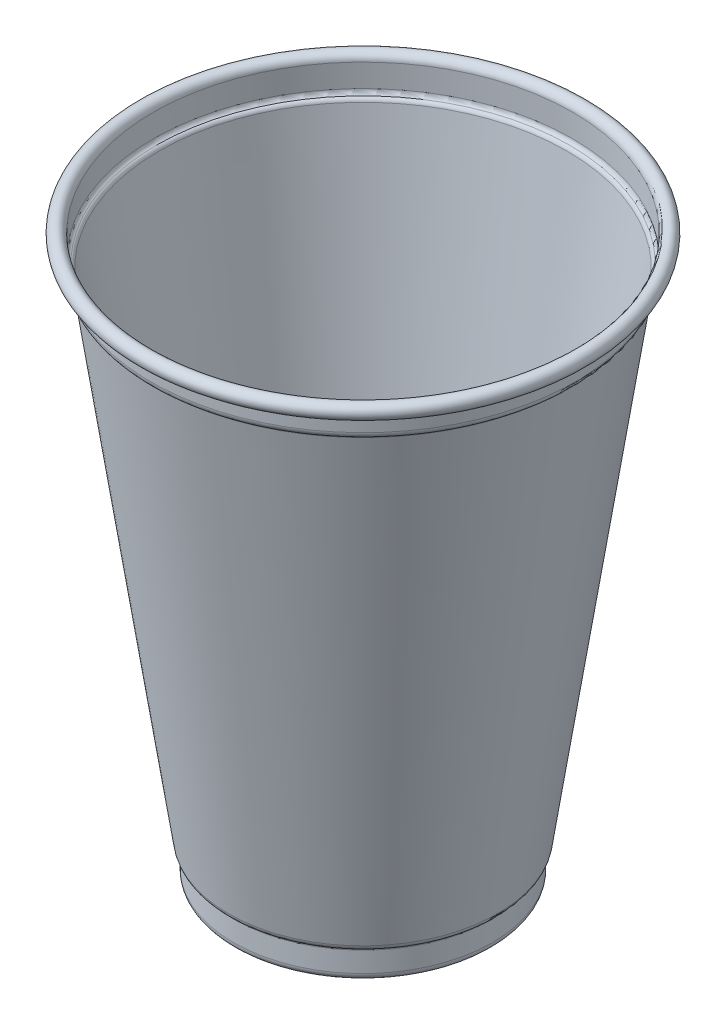
ISO-10303-21;
HEADER;
FILE_DESCRIPTION(('STEP AP214'),'2;1');
FILE_NAME('part.step','',(''),(''),'','','');
FILE_SCHEMA(('AUTOMOTIVE_DESIGN { 1 0 10303 214 1 1 1 1 }'));
ENDSEC;
DATA;
#1=APPLICATION_CONTEXT('core data for automotive mechanical design processes');
#2=APPLICATION_PROTOCOL_DEFINITION('international standard','automotive_design',2000,#1);
#3=PRODUCT_CONTEXT('',#1,'mechanical');
#4=PRODUCT('Part','Part','',(#3));
#5=PRODUCT_RELATED_PRODUCT_CATEGORY('part','',(#4));
#6=PRODUCT_DEFINITION_FORMATION('','',#4);
#7=PRODUCT_DEFINITION_CONTEXT('part definition',#1,'design');
#8=PRODUCT_DEFINITION('design','',#6,#7);
#9=PRODUCT_DEFINITION_SHAPE('','',#8);
#10=(LENGTH_UNIT() NAMED_UNIT(*) SI_UNIT(.MILLI.,.METRE.));
#11=(NAMED_UNIT(*) PLANE_ANGLE_UNIT() SI_UNIT($,.RADIAN.));
#12=(NAMED_UNIT(*) SI_UNIT($,.STERADIAN.) SOLID_ANGLE_UNIT());
#13=UNCERTAINTY_MEASURE_WITH_UNIT(LENGTH_MEASURE(1.E-05),#10,'distance_accuracy_value','');
#14=(GEOMETRIC_REPRESENTATION_CONTEXT(3) GLOBAL_UNCERTAINTY_ASSIGNED_CONTEXT((#13)) GLOBAL_UNIT_ASSIGNED_CONTEXT((#10,
#11,#12)) REPRESENTATION_CONTEXT('',''));
#15=CARTESIAN_POINT('',(0.,0.,0.));
#16=DIRECTION('',(0.,0.,1.));
#17=DIRECTION('',(1.,0.,0.));
#18=AXIS2_PLACEMENT_3D('',#15,#16,#17);
#19=CARTESIAN_POINT('',(0.,7.11442651473735,0.));
#20=DIRECTION('',(0.,-1.,0.));
#21=DIRECTION('',(0.,0.,-1.));
#22=AXIS2_PLACEMENT_3D('',#19,#20,#21);
#23=TOROIDAL_SURFACE('',#22,27.1827508937216,1.);
#24=CARTESIAN_POINT('',(0.,6.20721325736867,0.));
#25=DIRECTION('',(0.,-1.,0.));
#26=DIRECTION('',(0.,0.,-1.));
#27=AXIS2_PLACEMENT_3D('',#24,#25,#26);
#28=CIRCLE('',#27,27.6034219120418);
#29=CARTESIAN_POINT('',(0.,6.20721325736867,-27.6034219120418));
#30=VERTEX_POINT('',#29);
#31=EDGE_CURVE('E120',#30,#30,#28,.T.);
#32=ORIENTED_EDGE('',*,*,#31,.T.);
#33=EDGE_LOOP('',(#32));
#34=FACE_BOUND('',#33,.T.);
#35=CARTESIAN_POINT('',(0.,6.96931232730907,0.));
#36=DIRECTION('',(0.,-1.,0.));
#37=DIRECTION('',(0.,0.,-1.));
#38=AXIS2_PLACEMENT_3D('',#35,#36,#37);
#39=CIRCLE('',#38,28.1721658080053);
#40=CARTESIAN_POINT('',(0.,6.96931232730907,-28.1721658080053));
#41=VERTEX_POINT('',#40);
#42=EDGE_CURVE('E10',#41,#41,#39,.T.);
#43=ORIENTED_EDGE('',*,*,#42,.F.);
#44=EDGE_LOOP('',(#43));
#45=FACE_BOUND('',#44,.T.);
#46=ADVANCED_FACE('F32',(#34,#45),#23,.F.);
#47=CARTESIAN_POINT('',(0.,6.96931232730907,0.));
#48=DIRECTION('',(0.,1.,0.));
#49=DIRECTION('',(0.,0.,1.));
#50=AXIS2_PLACEMENT_3D('',#47,#48,#49);
#51=CONICAL_SURFACE('',#50,28.1721658080053,0.145628380570823);
#52=CARTESIAN_POINT('',(0.,111.845114187428,0.));
#53=DIRECTION('',(0.,-1.,0.));
#54=DIRECTION('',(0.,0.,-1.));
#55=AXIS2_PLACEMENT_3D('',#52,#53,#54);
#56=CIRCLE('',#55,43.5539500808228);
#57=CARTESIAN_POINT('',(0.,111.845114187428,-43.5539500808228));
#58=VERTEX_POINT('',#57);
#59=EDGE_CURVE('E38',#58,#58,#56,.T.);
#60=ORIENTED_EDGE('',*,*,#59,.F.);
#61=EDGE_LOOP('',(#60));
#62=FACE_BOUND('',#61,.T.);
#63=ORIENTED_EDGE('',*,*,#42,.T.);
#64=EDGE_LOOP('',(#63));
#65=FACE_BOUND('',#64,.T.);
#66=ADVANCED_FACE('F138',(#62,#65),#51,.F.);
#67=CARTESIAN_POINT('',(0.,111.7,0.));
#68=DIRECTION('',(0.,-1.,0.));
#69=DIRECTION('',(0.,0.,-1.));
#70=AXIS2_PLACEMENT_3D('',#67,#68,#69);
#71=TOROIDAL_SURFACE('',#70,44.5433649951065,1.);
#72=ORIENTED_EDGE('',*,*,#59,.T.);
#73=EDGE_LOOP('',(#72));
#74=FACE_BOUND('',#73,.T.);
#75=CARTESIAN_POINT('',(0.,112.617955879187,0.));
#76=DIRECTION('',(0.,-1.,0.));
#77=DIRECTION('',(0.,0.,-1.));
#78=AXIS2_PLACEMENT_3D('',#75,#76,#77);
#79=CIRCLE('',#78,44.1466824975533);
#80=CARTESIAN_POINT('',(0.,112.617955879187,-44.1466824975533));
#81=VERTEX_POINT('',#80);
#82=EDGE_CURVE('E42',#81,#81,#79,.T.);
#83=ORIENTED_EDGE('',*,*,#82,.F.);
#84=EDGE_LOOP('',(#83));
#85=FACE_BOUND('',#84,.T.);
#86=ADVANCED_FACE('F143',(#74,#85),#71,.T.);
#87=CARTESIAN_POINT('',(0.,113.535911758375,0.));
#88=DIRECTION('',(0.,-1.,0.));
#89=DIRECTION('',(0.,0.,-1.));
#90=AXIS2_PLACEMENT_3D('',#87,#88,#89);
#91=TOROIDAL_SURFACE('',#90,43.75,1.);
#92=ORIENTED_EDGE('',*,*,#82,.T.);
#93=EDGE_LOOP('',(#92));
#94=FACE_BOUND('',#93,.T.);
#95=CARTESIAN_POINT('',(0.,113.535911758375,0.));
#96=DIRECTION('',(0.,-1.,0.));
#97=DIRECTION('',(0.,0.,-1.));
#98=AXIS2_PLACEMENT_3D('',#95,#96,#97);
#99=CIRCLE('',#98,44.75);
#100=CARTESIAN_POINT('',(0.,113.535911758375,-44.75));
#101=VERTEX_POINT('',#100);
#102=EDGE_CURVE('E46',#101,#101,#99,.T.);
#103=ORIENTED_EDGE('',*,*,#102,.F.);
#104=EDGE_LOOP('',(#103));
#105=FACE_BOUND('',#104,.T.);
#106=ADVANCED_FACE('F149',(#94,#105),#91,.F.);
#107=CARTESIAN_POINT('',(0.,0.,0.));
#108=DIRECTION('',(0.,-1.,0.));
#109=DIRECTION('',(0.,0.,-1.));
#110=AXIS2_PLACEMENT_3D('',#107,#108,#109);
#111=CYLINDRICAL_SURFACE('',#110,44.75);
#112=ORIENTED_EDGE('',*,*,#102,.T.);
#113=EDGE_LOOP('',(#112));
#114=FACE_BOUND('',#113,.T.);
#115=CARTESIAN_POINT('',(0.,118.435222207308,0.));
#116=DIRECTION('',(0.,-1.,0.));
#117=DIRECTION('',(0.,0.,-1.));
#118=AXIS2_PLACEMENT_3D('',#115,#116,#117);
#119=CIRCLE('',#118,44.75);
#120=CARTESIAN_POINT('',(0.,118.435222207308,-44.75));
#121=VERTEX_POINT('',#120);
#122=EDGE_CURVE('E51',#121,#121,#119,.T.);
#123=ORIENTED_EDGE('',*,*,#122,.F.);
#124=EDGE_LOOP('',(#123));
#125=FACE_BOUND('',#124,.T.);
#126=ADVANCED_FACE('F154',(#114,#125),#111,.F.);
#127=CARTESIAN_POINT('',(0.,118.435222207308,0.));
#128=DIRECTION('',(0.,-1.,0.));
#129=DIRECTION('',(0.,0.,-1.));
#130=AXIS2_PLACEMENT_3D('',#127,#128,#129);
#131=TOROIDAL_SURFACE('',#130,46.2971345541354,1.54713455413545);
#132=CARTESIAN_POINT('',(0.,117.053809984678,0.));
#133=DIRECTION('',(0.,-1.,0.));
#134=DIRECTION('',(0.,0.,-1.));
#135=AXIS2_PLACEMENT_3D('',#132,#133,#134);
#136=CIRCLE('',#135,45.600481412486);
#137=CARTESIAN_POINT('',(0.,117.053809984678,-45.600481412486));
#138=VERTEX_POINT('',#137);
#139=EDGE_CURVE('E54',#138,#138,#136,.T.);
#140=ORIENTED_EDGE('',*,*,#139,.F.);
#141=EDGE_LOOP('',(#140));
#142=FACE_BOUND('',#141,.T.);
#143=ORIENTED_EDGE('',*,*,#122,.T.);
#144=EDGE_LOOP('',(#143));
#145=FACE_BOUND('',#144,.T.);
#146=ADVANCED_FACE('F158',(#142,#145),#131,.T.);
#147=CARTESIAN_POINT('',(0.,117.499602171082,0.));
#148=DIRECTION('',(0.,1.,0.));
#149=DIRECTION('',(0.,0.,1.));
#150=AXIS2_PLACEMENT_3D('',#147,#148,#149);
#151=CONICAL_SURFACE('',#150,45.826915538913,0.469976638417015);
#152=ORIENTED_EDGE('',*,*,#139,.T.);
#153=EDGE_LOOP('',(#152));
#154=FACE_BOUND('',#153,.T.);
#155=CARTESIAN_POINT('',(0.,117.499602171082,0.));
#156=DIRECTION('',(0.,-1.,0.));
#157=DIRECTION('',(0.,0.,-1.));
#158=AXIS2_PLACEMENT_3D('',#155,#156,#157);
#159=CIRCLE('',#158,45.826915538913);
#160=CARTESIAN_POINT('',(0.,117.499602171082,-45.826915538913));
#161=VERTEX_POINT('',#160);
#162=EDGE_CURVE('E57',#161,#161,#159,.T.);
#163=ORIENTED_EDGE('',*,*,#162,.F.);
#164=EDGE_LOOP('',(#163));
#165=FACE_BOUND('',#164,.T.);
#166=ADVANCED_FACE('F161',(#154,#165),#151,.F.);
#167=CARTESIAN_POINT('',(0.,118.435222207308,0.));
#168=DIRECTION('',(0.,-1.,0.));
#169=DIRECTION('',(0.,0.,-1.));
#170=AXIS2_PLACEMENT_3D('',#167,#168,#169);
#171=TOROIDAL_SURFACE('',#170,46.2971345541354,1.04713455413546);
#172=ORIENTED_EDGE('',*,*,#162,.T.);
#173=EDGE_LOOP('',(#172));
#174=FACE_BOUND('',#173,.T.);
#175=CARTESIAN_POINT('',(0.,118.435222207308,0.));
#176=DIRECTION('',(0.,-1.,0.));
#177=DIRECTION('',(0.,0.,-1.));
#178=AXIS2_PLACEMENT_3D('',#175,#176,#177);
#179=CIRCLE('',#178,45.25);
#180=CARTESIAN_POINT('',(0.,118.435222207308,-45.25));
#181=VERTEX_POINT('',#180);
#182=EDGE_CURVE('E60',#181,#181,#179,.T.);
#183=ORIENTED_EDGE('',*,*,#182,.F.);
#184=EDGE_LOOP('',(#183));
#185=FACE_BOUND('',#184,.T.);
#186=ADVANCED_FACE('F165',(#174,#185),#171,.F.);
#187=CARTESIAN_POINT('',(0.,0.,0.));
#188=DIRECTION('',(0.,-1.,0.));
#189=DIRECTION('',(0.,0.,-1.));
#190=AXIS2_PLACEMENT_3D('',#187,#188,#189);
#191=CYLINDRICAL_SURFACE('',#190,45.25);
#192=CARTESIAN_POINT('',(0.,113.535911758375,0.));
#193=DIRECTION('',(0.,-1.,0.));
#194=DIRECTION('',(0.,0.,-1.));
#195=AXIS2_PLACEMENT_3D('',#192,#193,#194);
#196=CIRCLE('',#195,45.25);
#197=CARTESIAN_POINT('',(0.,113.535911758375,-45.25));
#198=VERTEX_POINT('',#197);
#199=EDGE_CURVE('E63',#198,#198,#196,.T.);
#200=ORIENTED_EDGE('',*,*,#199,.F.);
#201=EDGE_LOOP('',(#200));
#202=FACE_BOUND('',#201,.T.);
#203=ORIENTED_EDGE('',*,*,#182,.T.);
#204=EDGE_LOOP('',(#203));
#205=FACE_BOUND('',#204,.T.);
#206=ADVANCED_FACE('F169',(#202,#205),#191,.T.);
#207=CARTESIAN_POINT('',(0.,113.535911758375,0.));
#208=DIRECTION('',(0.,-1.,0.));
#209=DIRECTION('',(0.,0.,-1.));
#210=AXIS2_PLACEMENT_3D('',#207,#208,#209);
#211=TOROIDAL_SURFACE('',#210,43.75,1.5);
#212=CARTESIAN_POINT('',(0.,112.158977939594,0.));
#213=DIRECTION('',(0.,-1.,0.));
#214=DIRECTION('',(0.,0.,-1.));
#215=AXIS2_PLACEMENT_3D('',#212,#213,#214);
#216=CIRCLE('',#215,44.3450237463299);
#217=CARTESIAN_POINT('',(0.,112.158977939594,-44.3450237463299));
#218=VERTEX_POINT('',#217);
#219=EDGE_CURVE('E66',#218,#218,#216,.T.);
#220=ORIENTED_EDGE('',*,*,#219,.F.);
#221=EDGE_LOOP('',(#220));
#222=FACE_BOUND('',#221,.T.);
#223=ORIENTED_EDGE('',*,*,#199,.T.);
#224=EDGE_LOOP('',(#223));
#225=FACE_BOUND('',#224,.T.);
#226=ADVANCED_FACE('F173',(#222,#225),#211,.T.);
#227=CARTESIAN_POINT('',(0.,111.7,0.));
#228=DIRECTION('',(0.,-1.,0.));
#229=DIRECTION('',(0.,0.,-1.));
#230=AXIS2_PLACEMENT_3D('',#227,#228,#229);
#231=TOROIDAL_SURFACE('',#230,44.5433649951065,0.500000000000005);
#232=CARTESIAN_POINT('',(0.,111.772557093714,0.));
#233=DIRECTION('',(0.,-1.,0.));
#234=DIRECTION('',(0.,0.,-1.));
#235=AXIS2_PLACEMENT_3D('',#232,#233,#234);
#236=CIRCLE('',#235,44.0486575379647);
#237=CARTESIAN_POINT('',(0.,111.772557093714,-44.0486575379647));
#238=VERTEX_POINT('',#237);
#239=EDGE_CURVE('E69',#238,#238,#236,.T.);
#240=ORIENTED_EDGE('',*,*,#239,.F.);
#241=EDGE_LOOP('',(#240));
#242=FACE_BOUND('',#241,.T.);
#243=ORIENTED_EDGE('',*,*,#219,.T.);
#244=EDGE_LOOP('',(#243));
#245=FACE_BOUND('',#244,.T.);
#246=ADVANCED_FACE('F177',(#242,#245),#231,.F.);
#247=CARTESIAN_POINT('',(0.,6.89675523359494,0.));
#248=DIRECTION('',(0.,1.,0.));
#249=DIRECTION('',(0.,0.,1.));
#250=AXIS2_PLACEMENT_3D('',#247,#248,#249);
#251=CONICAL_SURFACE('',#250,28.6668732651472,0.145628380570822);
#252=ORIENTED_EDGE('',*,*,#239,.T.);
#253=EDGE_LOOP('',(#252));
#254=FACE_BOUND('',#253,.T.);
#255=CARTESIAN_POINT('',(0.,6.89675523359494,0.));
#256=DIRECTION('',(0.,-1.,0.));
#257=DIRECTION('',(0.,0.,-1.));
#258=AXIS2_PLACEMENT_3D('',#255,#256,#257);
#259=CIRCLE('',#258,28.6668732651472);
#260=CARTESIAN_POINT('',(0.,6.89675523359494,-28.6668732651472));
#261=VERTEX_POINT('',#260);
#262=EDGE_CURVE('E72',#261,#261,#259,.T.);
#263=ORIENTED_EDGE('',*,*,#262,.F.);
#264=EDGE_LOOP('',(#263));
#265=FACE_BOUND('',#264,.T.);
#266=ADVANCED_FACE('F181',(#254,#265),#251,.T.);
#267=CARTESIAN_POINT('',(0.,7.11442651473735,0.));
#268=DIRECTION('',(0.,-1.,0.));
#269=DIRECTION('',(0.,0.,-1.));
#270=AXIS2_PLACEMENT_3D('',#267,#268,#269);
#271=TOROIDAL_SURFACE('',#270,27.1827508937216,1.5);
#272=CARTESIAN_POINT('',(0.,5.75360662868432,0.));
#273=DIRECTION('',(0.,-1.,0.));
#274=DIRECTION('',(0.,0.,-1.));
#275=AXIS2_PLACEMENT_3D('',#272,#273,#274);
#276=CIRCLE('',#275,27.8137574212018);
#277=CARTESIAN_POINT('',(0.,5.75360662868432,-27.8137574212018));
#278=VERTEX_POINT('',#277);
#279=EDGE_CURVE('E75',#278,#278,#276,.T.);
#280=ORIENTED_EDGE('',*,*,#279,.F.);
#281=EDGE_LOOP('',(#280));
#282=FACE_BOUND('',#281,.T.);
#283=ORIENTED_EDGE('',*,*,#262,.T.);
#284=EDGE_LOOP('',(#283));
#285=FACE_BOUND('',#284,.T.);
#286=ADVANCED_FACE('F184',(#282,#285),#271,.T.);
#287=CARTESIAN_POINT('',(0.,5.29999999999998,0.));
#288=DIRECTION('',(0.,-1.,0.));
#289=DIRECTION('',(0.,0.,-1.));
#290=AXIS2_PLACEMENT_3D('',#287,#288,#289);
#291=TOROIDAL_SURFACE('',#290,28.0240929303619,0.500000000000002);
#292=CARTESIAN_POINT('',(0.,5.28809861102683,0.));
#293=DIRECTION('',(0.,-1.,0.));
#294=DIRECTION('',(0.,0.,-1.));
#295=AXIS2_PLACEMENT_3D('',#292,#293,#294);
#296=CIRCLE('',#295,27.5242345934898);
#297=CARTESIAN_POINT('',(0.,5.28809861102683,-27.5242345934898));
#298=VERTEX_POINT('',#297);
#299=EDGE_CURVE('E78',#298,#298,#296,.T.);
#300=ORIENTED_EDGE('',*,*,#299,.F.);
#301=EDGE_LOOP('',(#300));
#302=FACE_BOUND('',#301,.T.);
#303=ORIENTED_EDGE('',*,*,#279,.T.);
#304=EDGE_LOOP('',(#303));
#305=FACE_BOUND('',#304,.T.);
#306=ADVANCED_FACE('F188',(#302,#305),#291,.F.);
#307=CARTESIAN_POINT('',(0.,5.28809861102683,0.));
#308=DIRECTION('',(0.,-1.,0.));
#309=DIRECTION('',(0.,0.,-1.));
#310=AXIS2_PLACEMENT_3D('',#307,#308,#309);
#311=CONICAL_SURFACE('',#310,27.5242345934898,0.0238050261850705);
#312=CARTESIAN_POINT('',(0.,1.03570416691944,0.));
#313=DIRECTION('',(0.,-1.,0.));
#314=DIRECTION('',(0.,0.,-1.));
#315=AXIS2_PLACEMENT_3D('',#312,#313,#314);
#316=CIRCLE('',#315,27.6254820802543);
#317=CARTESIAN_POINT('',(0.,1.03570416691944,-27.6254820802543));
#318=VERTEX_POINT('',#317);
#319=EDGE_CURVE('E81',#318,#318,#316,.T.);
#320=ORIENTED_EDGE('',*,*,#319,.F.);
#321=EDGE_LOOP('',(#320));
#322=FACE_BOUND('',#321,.T.);
#323=ORIENTED_EDGE('',*,*,#299,.T.);
#324=EDGE_LOOP('',(#323));
#325=FACE_BOUND('',#324,.T.);
#326=ADVANCED_FACE('F192',(#322,#325),#311,.T.);
#327=CARTESIAN_POINT('',(0.,0.999999999999997,0.));
#328=DIRECTION('',(0.,-1.,0.));
#329=DIRECTION('',(0.,0.,-1.));
#330=AXIS2_PLACEMENT_3D('',#327,#328,#329);
#331=TOROIDAL_SURFACE('',#330,26.1259070696381,1.5);
#332=CARTESIAN_POINT('',(0.,-0.500000000000004,0.));
#333=DIRECTION('',(0.,-1.,0.));
#334=DIRECTION('',(0.,0.,-1.));
#335=AXIS2_PLACEMENT_3D('',#332,#333,#334);
#336=CIRCLE('',#335,26.1259070696381);
#337=CARTESIAN_POINT('',(0.,-0.500000000000004,-26.1259070696381));
#338=VERTEX_POINT('',#337);
#339=EDGE_CURVE('E84',#338,#338,#336,.T.);
#340=ORIENTED_EDGE('',*,*,#339,.F.);
#341=EDGE_LOOP('',(#340));
#342=FACE_BOUND('',#341,.T.);
#343=ORIENTED_EDGE('',*,*,#319,.T.);
#344=EDGE_LOOP('',(#343));
#345=FACE_BOUND('',#344,.T.);
#346=ADVANCED_FACE('F196',(#342,#345),#331,.T.);
#347=CARTESIAN_POINT('',(-26.1259070696381,-0.500000000000004,0.));
#348=DIRECTION('',(0.,1.,0.));
#349=DIRECTION('',(0.,0.,1.));
#350=AXIS2_PLACEMENT_3D('',#347,#348,#349);
#351=PLANE('',#350);
#352=CARTESIAN_POINT('',(0.,-0.500000000000003,0.));
#353=DIRECTION('',(0.,-1.,0.));
#354=DIRECTION('',(0.,0.,-1.));
#355=AXIS2_PLACEMENT_3D('',#352,#353,#354);
#356=CIRCLE('',#355,19.6320353043957);
#357=CARTESIAN_POINT('',(0.,-0.500000000000003,-19.6320353043957));
#358=VERTEX_POINT('',#357);
#359=EDGE_CURVE('E87',#358,#358,#356,.T.);
#360=ORIENTED_EDGE('',*,*,#359,.F.);
#361=EDGE_LOOP('',(#360));
#362=FACE_BOUND('',#361,.T.);
#363=ORIENTED_EDGE('',*,*,#339,.T.);
#364=EDGE_LOOP('',(#363));
#365=FACE_BOUND('',#364,.T.);
#366=ADVANCED_FACE('F200',(#362,#365),#351,.F.);
#367=CARTESIAN_POINT('',(0.,0.999999999999998,0.));
#368=DIRECTION('',(0.,-1.,0.));
#369=DIRECTION('',(0.,0.,-1.));
#370=AXIS2_PLACEMENT_3D('',#367,#368,#369);
#371=TOROIDAL_SURFACE('',#370,19.6320353043957,1.5);
#372=CARTESIAN_POINT('',(0.,-0.278951336838081,0.));
#373=DIRECTION('',(0.,-1.,0.));
#374=DIRECTION('',(0.,0.,-1.));
#375=AXIS2_PLACEMENT_3D('',#372,#373,#374);
#376=CIRCLE('',#375,18.8482729182097);
#377=CARTESIAN_POINT('',(0.,-0.278951336838081,-18.8482729182097));
#378=VERTEX_POINT('',#377);
#379=EDGE_CURVE('E90',#378,#378,#376,.T.);
#380=ORIENTED_EDGE('',*,*,#379,.F.);
#381=EDGE_LOOP('',(#380));
#382=FACE_BOUND('',#381,.T.);
#383=ORIENTED_EDGE('',*,*,#359,.T.);
#384=EDGE_LOOP('',(#383));
#385=FACE_BOUND('',#384,.T.);
#386=ADVANCED_FACE('F204',(#382,#385),#371,.T.);
#387=CARTESIAN_POINT('',(0.,-0.278951336838081,0.));
#388=DIRECTION('',(0.,-1.,0.));
#389=DIRECTION('',(0.,0.,-1.));
#390=AXIS2_PLACEMENT_3D('',#387,#388,#389);
#391=CONICAL_SURFACE('',#390,18.8482729182097,1.02100624446148);
#392=CARTESIAN_POINT('',(0.,0.276317112279349,0.));
#393=DIRECTION('',(0.,-1.,0.));
#394=DIRECTION('',(0.,0.,-1.));
#395=AXIS2_PLACEMENT_3D('',#392,#393,#394);
#396=CIRCLE('',#395,17.9421802837334);
#397=CARTESIAN_POINT('',(0.,0.276317112279349,-17.9421802837334));
#398=VERTEX_POINT('',#397);
#399=EDGE_CURVE('E93',#398,#398,#396,.T.);
#400=ORIENTED_EDGE('',*,*,#399,.F.);
#401=EDGE_LOOP('',(#400));
#402=FACE_BOUND('',#401,.T.);
#403=ORIENTED_EDGE('',*,*,#379,.T.);
#404=EDGE_LOOP('',(#403));
#405=FACE_BOUND('',#404,.T.);
#406=ADVANCED_FACE('F208',(#402,#405),#391,.F.);
#407=CARTESIAN_POINT('',(0.,-0.150000000000009,0.));
#408=DIRECTION('',(0.,-1.,0.));
#409=DIRECTION('',(0.,0.,-1.));
#410=AXIS2_PLACEMENT_3D('',#407,#408,#409);
#411=TOROIDAL_SURFACE('',#410,17.6809261550047,0.5);
#412=CARTESIAN_POINT('',(0.,0.349999999999991,0.));
#413=DIRECTION('',(0.,-1.,0.));
#414=DIRECTION('',(0.,0.,-1.));
#415=AXIS2_PLACEMENT_3D('',#412,#413,#414);
#416=CIRCLE('',#415,17.6809261550047);
#417=CARTESIAN_POINT('',(0.,0.349999999999991,-17.6809261550047));
#418=VERTEX_POINT('',#417);
#419=EDGE_CURVE('E96',#418,#418,#416,.T.);
#420=ORIENTED_EDGE('',*,*,#419,.F.);
#421=EDGE_LOOP('',(#420));
#422=FACE_BOUND('',#421,.T.);
#423=ORIENTED_EDGE('',*,*,#399,.T.);
#424=EDGE_LOOP('',(#423));
#425=FACE_BOUND('',#424,.T.);
#426=ADVANCED_FACE('F212',(#422,#425),#411,.F.);
#427=CARTESIAN_POINT('',(-17.6809261550047,0.349999999999991,0.));
#428=DIRECTION('',(0.,1.,0.));
#429=DIRECTION('',(0.,0.,1.));
#430=AXIS2_PLACEMENT_3D('',#427,#428,#429);
#431=PLANE('',#430);
#432=ORIENTED_EDGE('',*,*,#419,.T.);
#433=EDGE_LOOP('',(#432));
#434=FACE_BOUND('',#433,.T.);
#435=ADVANCED_FACE('F216',(#434),#431,.F.);
#436=CARTESIAN_POINT('',(-17.6809261550047,0.849999999999991,0.));
#437=DIRECTION('',(0.,1.,0.));
#438=DIRECTION('',(0.,0.,1.));
#439=AXIS2_PLACEMENT_3D('',#436,#437,#438);
#440=PLANE('',#439);
#441=CARTESIAN_POINT('',(0.,0.849999999999991,0.));
#442=DIRECTION('',(0.,-1.,0.));
#443=DIRECTION('',(0.,0.,-1.));
#444=AXIS2_PLACEMENT_3D('',#441,#442,#443);
#445=CIRCLE('',#444,17.6809261550047);
#446=CARTESIAN_POINT('',(0.,0.849999999999991,-17.6809261550047));
#447=VERTEX_POINT('',#446);
#448=EDGE_CURVE('E99',#447,#447,#445,.T.);
#449=ORIENTED_EDGE('',*,*,#448,.F.);
#450=EDGE_LOOP('',(#449));
#451=FACE_BOUND('',#450,.T.);
#452=ADVANCED_FACE('F220',(#451),#440,.T.);
#453=CARTESIAN_POINT('',(0.,-0.150000000000009,0.));
#454=DIRECTION('',(0.,-1.,0.));
#455=DIRECTION('',(0.,0.,-1.));
#456=AXIS2_PLACEMENT_3D('',#453,#454,#455);
#457=TOROIDAL_SURFACE('',#456,17.6809261550047,1.);
#458=ORIENTED_EDGE('',*,*,#448,.T.);
#459=EDGE_LOOP('',(#458));
#460=FACE_BOUND('',#459,.T.);
#461=CARTESIAN_POINT('',(0.,0.70263422455871,0.));
#462=DIRECTION('',(0.,-1.,0.));
#463=DIRECTION('',(0.,0.,-1.));
#464=AXIS2_PLACEMENT_3D('',#461,#462,#463);
#465=CIRCLE('',#464,18.2034344124621);
#466=CARTESIAN_POINT('',(0.,0.70263422455871,-18.2034344124621));
#467=VERTEX_POINT('',#466);
#468=EDGE_CURVE('E102',#467,#467,#465,.T.);
#469=ORIENTED_EDGE('',*,*,#468,.F.);
#470=EDGE_LOOP('',(#469));
#471=FACE_BOUND('',#470,.T.);
#472=ADVANCED_FACE('F224',(#460,#471),#457,.T.);
#473=CARTESIAN_POINT('',(0.,0.14736577544128,0.));
#474=DIRECTION('',(0.,-1.,0.));
#475=DIRECTION('',(0.,0.,-1.));
#476=AXIS2_PLACEMENT_3D('',#473,#474,#475);
#477=CONICAL_SURFACE('',#476,19.1095270469384,1.02100624446148);
#478=ORIENTED_EDGE('',*,*,#468,.T.);
#479=EDGE_LOOP('',(#478));
#480=FACE_BOUND('',#479,.T.);
#481=CARTESIAN_POINT('',(0.,0.14736577544128,0.));
#482=DIRECTION('',(0.,-1.,0.));
#483=DIRECTION('',(0.,0.,-1.));
#484=AXIS2_PLACEMENT_3D('',#481,#482,#483);
#485=CIRCLE('',#484,19.1095270469384);
#486=CARTESIAN_POINT('',(0.,0.14736577544128,-19.1095270469384));
#487=VERTEX_POINT('',#486);
#488=EDGE_CURVE('E105',#487,#487,#485,.T.);
#489=ORIENTED_EDGE('',*,*,#488,.F.);
#490=EDGE_LOOP('',(#489));
#491=FACE_BOUND('',#490,.T.);
#492=ADVANCED_FACE('F228',(#480,#491),#477,.T.);
#493=CARTESIAN_POINT('',(0.,0.999999999999998,0.));
#494=DIRECTION('',(0.,-1.,0.));
#495=DIRECTION('',(0.,0.,-1.));
#496=AXIS2_PLACEMENT_3D('',#493,#494,#495);
#497=TOROIDAL_SURFACE('',#496,19.6320353043957,1.);
#498=ORIENTED_EDGE('',*,*,#488,.T.);
#499=EDGE_LOOP('',(#498));
#500=FACE_BOUND('',#499,.T.);
#501=CARTESIAN_POINT('',(0.,0.,0.));
#502=DIRECTION('',(0.,-1.,0.));
#503=DIRECTION('',(0.,0.,-1.));
#504=AXIS2_PLACEMENT_3D('',#501,#502,#503);
#505=CIRCLE('',#504,19.6320353043957);
#506=CARTESIAN_POINT('',(0.,0.,-19.6320353043957));
#507=VERTEX_POINT('',#506);
#508=EDGE_CURVE('E108',#507,#507,#505,.T.);
#509=ORIENTED_EDGE('',*,*,#508,.F.);
#510=EDGE_LOOP('',(#509));
#511=FACE_BOUND('',#510,.T.);
#512=ADVANCED_FACE('F232',(#500,#511),#497,.F.);
#513=CARTESIAN_POINT('',(-26.1259070696381,0.,0.));
#514=DIRECTION('',(0.,1.,0.));
#515=DIRECTION('',(0.,0.,1.));
#516=AXIS2_PLACEMENT_3D('',#513,#514,#515);
#517=PLANE('',#516);
#518=ORIENTED_EDGE('',*,*,#508,.T.);
#519=EDGE_LOOP('',(#518));
#520=FACE_BOUND('',#519,.T.);
#521=CARTESIAN_POINT('',(0.,0.,0.));
#522=DIRECTION('',(0.,-1.,0.));
#523=DIRECTION('',(0.,0.,-1.));
#524=AXIS2_PLACEMENT_3D('',#521,#522,#523);
#525=CIRCLE('',#524,26.1259070696381);
#526=CARTESIAN_POINT('',(0.,0.,-26.1259070696381));
#527=VERTEX_POINT('',#526);
#528=EDGE_CURVE('E111',#527,#527,#525,.T.);
#529=ORIENTED_EDGE('',*,*,#528,.F.);
#530=EDGE_LOOP('',(#529));
#531=FACE_BOUND('',#530,.T.);
#532=ADVANCED_FACE('F236',(#520,#531),#517,.T.);
#533=CARTESIAN_POINT('',(0.,0.999999999999997,0.));
#534=DIRECTION('',(0.,-1.,0.));
#535=DIRECTION('',(0.,0.,-1.));
#536=AXIS2_PLACEMENT_3D('',#533,#534,#535);
#537=TOROIDAL_SURFACE('',#536,26.1259070696381,1.);
#538=ORIENTED_EDGE('',*,*,#528,.T.);
#539=EDGE_LOOP('',(#538));
#540=FACE_BOUND('',#539,.T.);
#541=CARTESIAN_POINT('',(0.,1.02380277794629,0.));
#542=DIRECTION('',(0.,-1.,0.));
#543=DIRECTION('',(0.,0.,-1.));
#544=AXIS2_PLACEMENT_3D('',#541,#542,#543);
#545=CIRCLE('',#544,27.1256237433822);
#546=CARTESIAN_POINT('',(0.,1.02380277794629,-27.1256237433822));
#547=VERTEX_POINT('',#546);
#548=EDGE_CURVE('E114',#547,#547,#545,.T.);
#549=ORIENTED_EDGE('',*,*,#548,.F.);
#550=EDGE_LOOP('',(#549));
#551=FACE_BOUND('',#550,.T.);
#552=ADVANCED_FACE('F134',(#540,#551),#537,.F.);
#553=CARTESIAN_POINT('',(0.,5.27619722205368,0.));
#554=DIRECTION('',(0.,-1.,0.));
#555=DIRECTION('',(0.,0.,-1.));
#556=AXIS2_PLACEMENT_3D('',#553,#554,#555);
#557=CONICAL_SURFACE('',#556,27.0243762566178,0.0238050261850706);
#558=ORIENTED_EDGE('',*,*,#548,.T.);
#559=EDGE_LOOP('',(#558));
#560=FACE_BOUND('',#559,.T.);
#561=CARTESIAN_POINT('',(0.,5.27619722205368,0.));
#562=DIRECTION('',(0.,-1.,0.));
#563=DIRECTION('',(0.,0.,-1.));
#564=AXIS2_PLACEMENT_3D('',#561,#562,#563);
#565=CIRCLE('',#564,27.0243762566178);
#566=CARTESIAN_POINT('',(0.,5.27619722205368,-27.0243762566178));
#567=VERTEX_POINT('',#566);
#568=EDGE_CURVE('E117',#567,#567,#565,.T.);
#569=ORIENTED_EDGE('',*,*,#568,.F.);
#570=EDGE_LOOP('',(#569));
#571=FACE_BOUND('',#570,.T.);
#572=ADVANCED_FACE('F128',(#560,#571),#557,.F.);
#573=CARTESIAN_POINT('',(0.,5.29999999999998,0.));
#574=DIRECTION('',(0.,-1.,0.));
#575=DIRECTION('',(0.,0.,-1.));
#576=AXIS2_PLACEMENT_3D('',#573,#574,#575);
#577=TOROIDAL_SURFACE('',#576,28.0240929303619,1.);
#578=ORIENTED_EDGE('',*,*,#568,.T.);
#579=EDGE_LOOP('',(#578));
#580=FACE_BOUND('',#579,.T.);
#581=ORIENTED_EDGE('',*,*,#31,.F.);
#582=EDGE_LOOP('',(#581));
#583=FACE_BOUND('',#582,.T.);
#584=ADVANCED_FACE('F126',(#580,#583),#577,.T.);
#585=CLOSED_SHELL('',(#46,#66,#86,#106,#126,#146,#166,#186,#206,#226,#246,#266,#286,#306,#326,
#346,#366,#386,#406,#426,#435,#452,#472,#492,#512,#532,#552,#572,#584));
#586=MANIFOLD_SOLID_BREP('B2',#585);
#587=ADVANCED_BREP_SHAPE_REPRESENTATION('',(#18,#586),#14);
#588=SHAPE_DEFINITION_REPRESENTATION(#9,#587);
ENDSEC;
END-ISO-10303-21;
